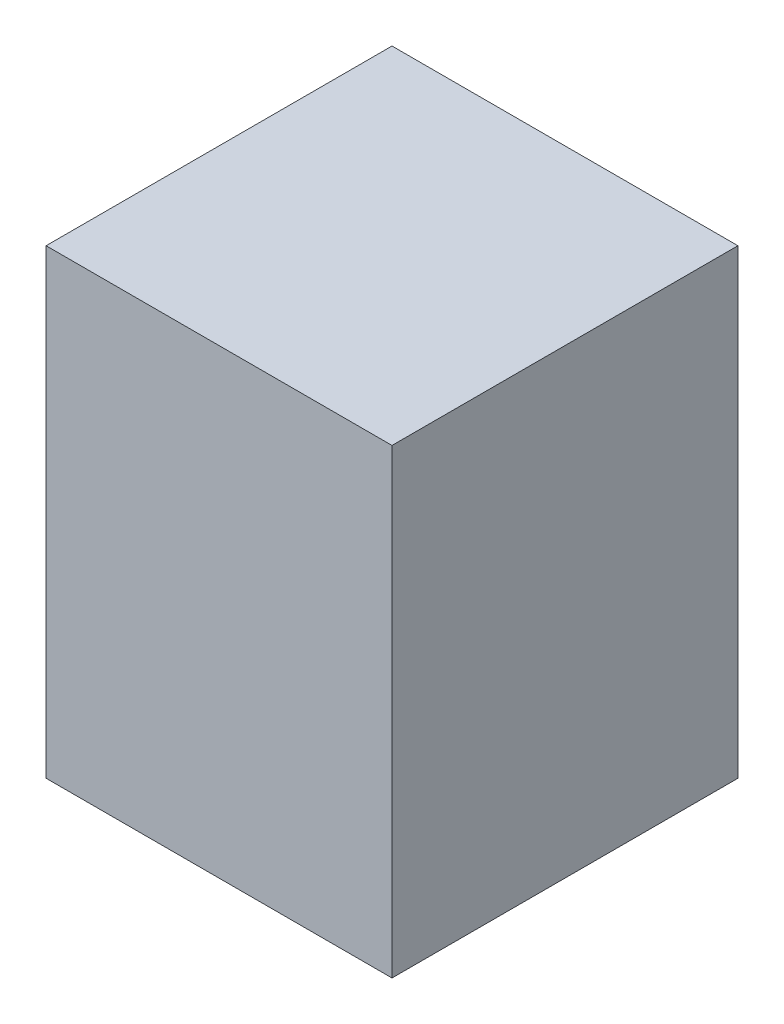
ISO-10303-21;
HEADER;
FILE_DESCRIPTION(('STEP AP214'),'2;1');
FILE_NAME('part.step','',(''),(''),'','','');
FILE_SCHEMA(('AUTOMOTIVE_DESIGN { 1 0 10303 214 1 1 1 1 }'));
ENDSEC;
DATA;
#1=APPLICATION_CONTEXT('core data for automotive mechanical design processes');
#2=APPLICATION_PROTOCOL_DEFINITION('international standard','automotive_design',2000,#1);
#3=PRODUCT_CONTEXT('',#1,'mechanical');
#4=PRODUCT('Part','Part','',(#3));
#5=PRODUCT_RELATED_PRODUCT_CATEGORY('part','',(#4));
#6=PRODUCT_DEFINITION_FORMATION('','',#4);
#7=PRODUCT_DEFINITION_CONTEXT('part definition',#1,'design');
#8=PRODUCT_DEFINITION('design','',#6,#7);
#9=PRODUCT_DEFINITION_SHAPE('','',#8);
#10=(LENGTH_UNIT() NAMED_UNIT(*) SI_UNIT(.MILLI.,.METRE.));
#11=(NAMED_UNIT(*) PLANE_ANGLE_UNIT() SI_UNIT($,.RADIAN.));
#12=(NAMED_UNIT(*) SI_UNIT($,.STERADIAN.) SOLID_ANGLE_UNIT());
#13=UNCERTAINTY_MEASURE_WITH_UNIT(LENGTH_MEASURE(1.E-05),#10,'distance_accuracy_value','');
#14=(GEOMETRIC_REPRESENTATION_CONTEXT(3) GLOBAL_UNCERTAINTY_ASSIGNED_CONTEXT((#13)) GLOBAL_UNIT_ASSIGNED_CONTEXT((#10,
#11,#12)) REPRESENTATION_CONTEXT('',''));
#15=CARTESIAN_POINT('',(0.,0.,0.));
#16=DIRECTION('',(0.,0.,1.));
#17=DIRECTION('',(1.,0.,0.));
#18=AXIS2_PLACEMENT_3D('',#15,#16,#17);
#19=CARTESIAN_POINT('',(0.,25.4,0.));
#20=DIRECTION('',(1.,0.,0.));
#21=DIRECTION('',(0.,0.,-1.));
#22=AXIS2_PLACEMENT_3D('',#19,#20,#21);
#23=PLANE('',#22);
#24=DIRECTION('',(0.,0.,1.));
#25=VECTOR('',#24,1.);
#26=CARTESIAN_POINT('',(0.,0.,0.));
#27=LINE('',#26,#25);
#28=CARTESIAN_POINT('',(0.,0.,-19.05));
#29=VERTEX_POINT('',#28);
#30=CARTESIAN_POINT('',(0.,0.,0.));
#31=VERTEX_POINT('',#30);
#32=EDGE_CURVE('E96',#29,#31,#27,.T.);
#33=ORIENTED_EDGE('',*,*,#32,.T.);
#34=DIRECTION('',(0.,-1.,0.));
#35=VECTOR('',#34,1.);
#36=CARTESIAN_POINT('',(0.,25.4,0.));
#37=LINE('',#36,#35);
#38=CARTESIAN_POINT('',(0.,25.4,0.));
#39=VERTEX_POINT('',#38);
#40=EDGE_CURVE('E11',#39,#31,#37,.T.);
#41=ORIENTED_EDGE('',*,*,#40,.F.);
#42=DIRECTION('',(0.,0.,1.));
#43=VECTOR('',#42,1.);
#44=CARTESIAN_POINT('',(0.,25.4,0.));
#45=LINE('',#44,#43);
#46=CARTESIAN_POINT('',(0.,25.4,-19.05));
#47=VERTEX_POINT('',#46);
#48=EDGE_CURVE('E84',#47,#39,#45,.T.);
#49=ORIENTED_EDGE('',*,*,#48,.F.);
#50=DIRECTION('',(0.,-1.,0.));
#51=VECTOR('',#50,1.);
#52=CARTESIAN_POINT('',(0.,25.4,-19.05));
#53=LINE('',#52,#51);
#54=EDGE_CURVE('E92',#47,#29,#53,.T.);
#55=ORIENTED_EDGE('',*,*,#54,.T.);
#56=EDGE_LOOP('',(#33,#41,#49,#55));
#57=FACE_BOUND('',#56,.T.);
#58=ADVANCED_FACE('F33',(#57),#23,.F.);
#59=CARTESIAN_POINT('',(0.,25.4,0.));
#60=DIRECTION('',(0.,0.,-1.));
#61=DIRECTION('',(-1.,0.,0.));
#62=AXIS2_PLACEMENT_3D('',#59,#60,#61);
#63=PLANE('',#62);
#64=DIRECTION('',(1.,0.,0.));
#65=VECTOR('',#64,1.);
#66=CARTESIAN_POINT('',(0.,0.,0.));
#67=LINE('',#66,#65);
#68=CARTESIAN_POINT('',(19.05,0.,0.));
#69=VERTEX_POINT('',#68);
#70=EDGE_CURVE('E88',#31,#69,#67,.T.);
#71=ORIENTED_EDGE('',*,*,#70,.T.);
#72=DIRECTION('',(0.,-1.,0.));
#73=VECTOR('',#72,1.);
#74=CARTESIAN_POINT('',(19.05,25.4,0.));
#75=LINE('',#74,#73);
#76=CARTESIAN_POINT('',(19.05,25.4,0.));
#77=VERTEX_POINT('',#76);
#78=EDGE_CURVE('E41',#77,#69,#75,.T.);
#79=ORIENTED_EDGE('',*,*,#78,.F.);
#80=DIRECTION('',(1.,0.,0.));
#81=VECTOR('',#80,1.);
#82=CARTESIAN_POINT('',(0.,25.4,0.));
#83=LINE('',#82,#81);
#84=EDGE_CURVE('E79',#39,#77,#83,.T.);
#85=ORIENTED_EDGE('',*,*,#84,.F.);
#86=ORIENTED_EDGE('',*,*,#40,.T.);
#87=EDGE_LOOP('',(#71,#79,#85,#86));
#88=FACE_BOUND('',#87,.T.);
#89=ADVANCED_FACE('F87',(#88),#63,.F.);
#90=CARTESIAN_POINT('',(19.05,25.4,0.));
#91=DIRECTION('',(-1.,0.,0.));
#92=DIRECTION('',(0.,0.,1.));
#93=AXIS2_PLACEMENT_3D('',#90,#91,#92);
#94=PLANE('',#93);
#95=DIRECTION('',(0.,0.,-1.));
#96=VECTOR('',#95,1.);
#97=CARTESIAN_POINT('',(19.05,0.,0.));
#98=LINE('',#97,#96);
#99=CARTESIAN_POINT('',(19.05,0.,-19.05));
#100=VERTEX_POINT('',#99);
#101=EDGE_CURVE('E66',#69,#100,#98,.T.);
#102=ORIENTED_EDGE('',*,*,#101,.T.);
#103=DIRECTION('',(0.,-1.,0.));
#104=VECTOR('',#103,1.);
#105=CARTESIAN_POINT('',(19.05,25.4,-19.05));
#106=LINE('',#105,#104);
#107=CARTESIAN_POINT('',(19.05,25.4,-19.05));
#108=VERTEX_POINT('',#107);
#109=EDGE_CURVE('E89',#108,#100,#106,.T.);
#110=ORIENTED_EDGE('',*,*,#109,.F.);
#111=DIRECTION('',(0.,0.,-1.));
#112=VECTOR('',#111,1.);
#113=CARTESIAN_POINT('',(19.05,25.4,0.));
#114=LINE('',#113,#112);
#115=EDGE_CURVE('E82',#77,#108,#114,.T.);
#116=ORIENTED_EDGE('',*,*,#115,.F.);
#117=ORIENTED_EDGE('',*,*,#78,.T.);
#118=EDGE_LOOP('',(#102,#110,#116,#117));
#119=FACE_BOUND('',#118,.T.);
#120=ADVANCED_FACE('F90',(#119),#94,.F.);
#121=CARTESIAN_POINT('',(0.,25.4,-19.05));
#122=DIRECTION('',(0.,0.,1.));
#123=DIRECTION('',(1.,0.,0.));
#124=AXIS2_PLACEMENT_3D('',#121,#122,#123);
#125=PLANE('',#124);
#126=DIRECTION('',(-1.,0.,0.));
#127=VECTOR('',#126,1.);
#128=CARTESIAN_POINT('',(0.,0.,-19.05));
#129=LINE('',#128,#127);
#130=EDGE_CURVE('E72',#100,#29,#129,.T.);
#131=ORIENTED_EDGE('',*,*,#130,.T.);
#132=ORIENTED_EDGE('',*,*,#54,.F.);
#133=DIRECTION('',(-1.,0.,0.));
#134=VECTOR('',#133,1.);
#135=CARTESIAN_POINT('',(0.,25.4,-19.05));
#136=LINE('',#135,#134);
#137=EDGE_CURVE('E49',#108,#47,#136,.T.);
#138=ORIENTED_EDGE('',*,*,#137,.F.);
#139=ORIENTED_EDGE('',*,*,#109,.T.);
#140=EDGE_LOOP('',(#131,#132,#138,#139));
#141=FACE_BOUND('',#140,.T.);
#142=ADVANCED_FACE('F103',(#141),#125,.F.);
#143=CARTESIAN_POINT('',(0.,25.4,0.));
#144=DIRECTION('',(0.,-1.,0.));
#145=DIRECTION('',(0.,0.,-1.));
#146=AXIS2_PLACEMENT_3D('',#143,#144,#145);
#147=PLANE('',#146);
#148=ORIENTED_EDGE('',*,*,#48,.T.);
#149=ORIENTED_EDGE('',*,*,#84,.T.);
#150=ORIENTED_EDGE('',*,*,#115,.T.);
#151=ORIENTED_EDGE('',*,*,#137,.T.);
#152=EDGE_LOOP('',(#148,#149,#150,#151));
#153=FACE_BOUND('',#152,.T.);
#154=ADVANCED_FACE('F80',(#153),#147,.F.);
#155=CARTESIAN_POINT('',(0.,0.,0.));
#156=DIRECTION('',(0.,-1.,0.));
#157=DIRECTION('',(0.,0.,-1.));
#158=AXIS2_PLACEMENT_3D('',#155,#156,#157);
#159=PLANE('',#158);
#160=ORIENTED_EDGE('',*,*,#32,.F.);
#161=ORIENTED_EDGE('',*,*,#130,.F.);
#162=ORIENTED_EDGE('',*,*,#101,.F.);
#163=ORIENTED_EDGE('',*,*,#70,.F.);
#164=EDGE_LOOP('',(#160,#161,#162,#163));
#165=FACE_BOUND('',#164,.T.);
#166=ADVANCED_FACE('F106',(#165),#159,.T.);
#167=CLOSED_SHELL('',(#58,#89,#120,#142,#154,#166));
#168=MANIFOLD_SOLID_BREP('B2',#167);
#169=ADVANCED_BREP_SHAPE_REPRESENTATION('',(#18,#168),#14);
#170=SHAPE_DEFINITION_REPRESENTATION(#9,#169);
ENDSEC;
END-ISO-10303-21;
